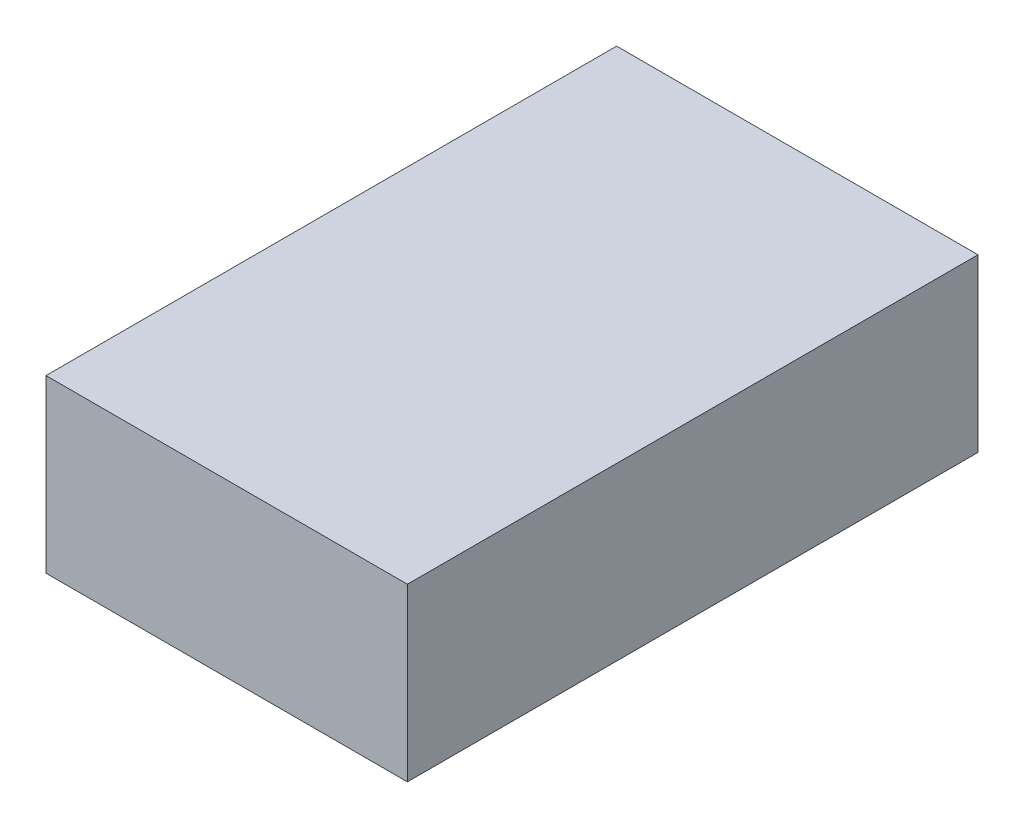
ISO-10303-21;
HEADER;
FILE_DESCRIPTION(('STEP AP214'),'2;1');
FILE_NAME('part.step','',(''),(''),'','','');
FILE_SCHEMA(('AUTOMOTIVE_DESIGN { 1 0 10303 214 1 1 1 1 }'));
ENDSEC;
DATA;
#1=APPLICATION_CONTEXT('core data for automotive mechanical design processes');
#2=APPLICATION_PROTOCOL_DEFINITION('international standard','automotive_design',2000,#1);
#3=PRODUCT_CONTEXT('',#1,'mechanical');
#4=PRODUCT('Part','Part','',(#3));
#5=PRODUCT_RELATED_PRODUCT_CATEGORY('part','',(#4));
#6=PRODUCT_DEFINITION_FORMATION('','',#4);
#7=PRODUCT_DEFINITION_CONTEXT('part definition',#1,'design');
#8=PRODUCT_DEFINITION('design','',#6,#7);
#9=PRODUCT_DEFINITION_SHAPE('','',#8);
#10=(LENGTH_UNIT() NAMED_UNIT(*) SI_UNIT(.MILLI.,.METRE.));
#11=(NAMED_UNIT(*) PLANE_ANGLE_UNIT() SI_UNIT($,.RADIAN.));
#12=(NAMED_UNIT(*) SI_UNIT($,.STERADIAN.) SOLID_ANGLE_UNIT());
#13=UNCERTAINTY_MEASURE_WITH_UNIT(LENGTH_MEASURE(1.E-05),#10,'distance_accuracy_value','');
#14=(GEOMETRIC_REPRESENTATION_CONTEXT(3) GLOBAL_UNCERTAINTY_ASSIGNED_CONTEXT((#13)) GLOBAL_UNIT_ASSIGNED_CONTEXT((#10,
#11,#12)) REPRESENTATION_CONTEXT('',''));
#15=CARTESIAN_POINT('',(0.,0.,0.));
#16=DIRECTION('',(0.,0.,1.));
#17=DIRECTION('',(1.,0.,0.));
#18=AXIS2_PLACEMENT_3D('',#15,#16,#17);
#19=CARTESIAN_POINT('',(0.,9.,0.));
#20=DIRECTION('',(1.,0.,0.));
#21=DIRECTION('',(0.,0.,-1.));
#22=AXIS2_PLACEMENT_3D('',#19,#20,#21);
#23=PLANE('',#22);
#24=DIRECTION('',(0.,0.,1.));
#25=VECTOR('',#24,1.);
#26=CARTESIAN_POINT('',(0.,0.,0.));
#27=LINE('',#26,#25);
#28=CARTESIAN_POINT('',(0.,0.,-30.));
#29=VERTEX_POINT('',#28);
#30=CARTESIAN_POINT('',(0.,0.,0.));
#31=VERTEX_POINT('',#30);
#32=EDGE_CURVE('E97',#29,#31,#27,.T.);
#33=ORIENTED_EDGE('',*,*,#32,.T.);
#34=DIRECTION('',(0.,-1.,0.));
#35=VECTOR('',#34,1.);
#36=CARTESIAN_POINT('',(0.,9.,0.));
#37=LINE('',#36,#35);
#38=CARTESIAN_POINT('',(0.,9.,0.));
#39=VERTEX_POINT('',#38);
#40=EDGE_CURVE('E11',#39,#31,#37,.T.);
#41=ORIENTED_EDGE('',*,*,#40,.F.);
#42=DIRECTION('',(0.,0.,1.));
#43=VECTOR('',#42,1.);
#44=CARTESIAN_POINT('',(0.,9.,0.));
#45=LINE('',#44,#43);
#46=CARTESIAN_POINT('',(0.,9.,-30.));
#47=VERTEX_POINT('',#46);
#48=EDGE_CURVE('E85',#47,#39,#45,.T.);
#49=ORIENTED_EDGE('',*,*,#48,.F.);
#50=DIRECTION('',(0.,-1.,0.));
#51=VECTOR('',#50,1.);
#52=CARTESIAN_POINT('',(0.,9.,-30.));
#53=LINE('',#52,#51);
#54=EDGE_CURVE('E93',#47,#29,#53,.T.);
#55=ORIENTED_EDGE('',*,*,#54,.T.);
#56=EDGE_LOOP('',(#33,#41,#49,#55));
#57=FACE_BOUND('',#56,.T.);
#58=ADVANCED_FACE('F34',(#57),#23,.F.);
#59=CARTESIAN_POINT('',(0.,9.,0.));
#60=DIRECTION('',(0.,0.,-1.));
#61=DIRECTION('',(-1.,0.,0.));
#62=AXIS2_PLACEMENT_3D('',#59,#60,#61);
#63=PLANE('',#62);
#64=DIRECTION('',(1.,0.,0.));
#65=VECTOR('',#64,1.);
#66=CARTESIAN_POINT('',(0.,0.,0.));
#67=LINE('',#66,#65);
#68=CARTESIAN_POINT('',(19.,0.,0.));
#69=VERTEX_POINT('',#68);
#70=EDGE_CURVE('E89',#31,#69,#67,.T.);
#71=ORIENTED_EDGE('',*,*,#70,.T.);
#72=DIRECTION('',(0.,-1.,0.));
#73=VECTOR('',#72,1.);
#74=CARTESIAN_POINT('',(19.,9.,0.));
#75=LINE('',#74,#73);
#76=CARTESIAN_POINT('',(19.,9.,0.));
#77=VERTEX_POINT('',#76);
#78=EDGE_CURVE('E42',#77,#69,#75,.T.);
#79=ORIENTED_EDGE('',*,*,#78,.F.);
#80=DIRECTION('',(1.,0.,0.));
#81=VECTOR('',#80,1.);
#82=CARTESIAN_POINT('',(0.,9.,0.));
#83=LINE('',#82,#81);
#84=EDGE_CURVE('E80',#39,#77,#83,.T.);
#85=ORIENTED_EDGE('',*,*,#84,.F.);
#86=ORIENTED_EDGE('',*,*,#40,.T.);
#87=EDGE_LOOP('',(#71,#79,#85,#86));
#88=FACE_BOUND('',#87,.T.);
#89=ADVANCED_FACE('F88',(#88),#63,.F.);
#90=CARTESIAN_POINT('',(19.,9.,0.));
#91=DIRECTION('',(-1.,0.,0.));
#92=DIRECTION('',(0.,0.,1.));
#93=AXIS2_PLACEMENT_3D('',#90,#91,#92);
#94=PLANE('',#93);
#95=DIRECTION('',(0.,0.,-1.));
#96=VECTOR('',#95,1.);
#97=CARTESIAN_POINT('',(19.,0.,0.));
#98=LINE('',#97,#96);
#99=CARTESIAN_POINT('',(19.,0.,-30.));
#100=VERTEX_POINT('',#99);
#101=EDGE_CURVE('E67',#69,#100,#98,.T.);
#102=ORIENTED_EDGE('',*,*,#101,.T.);
#103=DIRECTION('',(0.,-1.,0.));
#104=VECTOR('',#103,1.);
#105=CARTESIAN_POINT('',(19.,9.,-30.));
#106=LINE('',#105,#104);
#107=CARTESIAN_POINT('',(19.,9.,-30.));
#108=VERTEX_POINT('',#107);
#109=EDGE_CURVE('E90',#108,#100,#106,.T.);
#110=ORIENTED_EDGE('',*,*,#109,.F.);
#111=DIRECTION('',(0.,0.,-1.));
#112=VECTOR('',#111,1.);
#113=CARTESIAN_POINT('',(19.,9.,0.));
#114=LINE('',#113,#112);
#115=EDGE_CURVE('E83',#77,#108,#114,.T.);
#116=ORIENTED_EDGE('',*,*,#115,.F.);
#117=ORIENTED_EDGE('',*,*,#78,.T.);
#118=EDGE_LOOP('',(#102,#110,#116,#117));
#119=FACE_BOUND('',#118,.T.);
#120=ADVANCED_FACE('F91',(#119),#94,.F.);
#121=CARTESIAN_POINT('',(0.,9.,-30.));
#122=DIRECTION('',(0.,0.,1.));
#123=DIRECTION('',(1.,0.,0.));
#124=AXIS2_PLACEMENT_3D('',#121,#122,#123);
#125=PLANE('',#124);
#126=DIRECTION('',(-1.,0.,0.));
#127=VECTOR('',#126,1.);
#128=CARTESIAN_POINT('',(0.,0.,-30.));
#129=LINE('',#128,#127);
#130=EDGE_CURVE('E73',#100,#29,#129,.T.);
#131=ORIENTED_EDGE('',*,*,#130,.T.);
#132=ORIENTED_EDGE('',*,*,#54,.F.);
#133=DIRECTION('',(-1.,0.,0.));
#134=VECTOR('',#133,1.);
#135=CARTESIAN_POINT('',(0.,9.,-30.));
#136=LINE('',#135,#134);
#137=EDGE_CURVE('E50',#108,#47,#136,.T.);
#138=ORIENTED_EDGE('',*,*,#137,.F.);
#139=ORIENTED_EDGE('',*,*,#109,.T.);
#140=EDGE_LOOP('',(#131,#132,#138,#139));
#141=FACE_BOUND('',#140,.T.);
#142=ADVANCED_FACE('F104',(#141),#125,.F.);
#143=CARTESIAN_POINT('',(0.,9.,-30.));
#144=DIRECTION('',(0.,-1.,0.));
#145=DIRECTION('',(0.,0.,-1.));
#146=AXIS2_PLACEMENT_3D('',#143,#144,#145);
#147=PLANE('',#146);
#148=ORIENTED_EDGE('',*,*,#48,.T.);
#149=ORIENTED_EDGE('',*,*,#84,.T.);
#150=ORIENTED_EDGE('',*,*,#115,.T.);
#151=ORIENTED_EDGE('',*,*,#137,.T.);
#152=EDGE_LOOP('',(#148,#149,#150,#151));
#153=FACE_BOUND('',#152,.T.);
#154=ADVANCED_FACE('F81',(#153),#147,.F.);
#155=CARTESIAN_POINT('',(0.,0.,-30.));
#156=DIRECTION('',(0.,-1.,0.));
#157=DIRECTION('',(0.,0.,-1.));
#158=AXIS2_PLACEMENT_3D('',#155,#156,#157);
#159=PLANE('',#158);
#160=ORIENTED_EDGE('',*,*,#32,.F.);
#161=ORIENTED_EDGE('',*,*,#130,.F.);
#162=ORIENTED_EDGE('',*,*,#101,.F.);
#163=ORIENTED_EDGE('',*,*,#70,.F.);
#164=EDGE_LOOP('',(#160,#161,#162,#163));
#165=FACE_BOUND('',#164,.T.);
#166=ADVANCED_FACE('F107',(#165),#159,.T.);
#167=CLOSED_SHELL('',(#58,#89,#120,#142,#154,#166));
#168=MANIFOLD_SOLID_BREP('B2',#167);
#169=ADVANCED_BREP_SHAPE_REPRESENTATION('',(#18,#168),#14);
#170=SHAPE_DEFINITION_REPRESENTATION(#9,#169);
ENDSEC;
END-ISO-10303-21;
